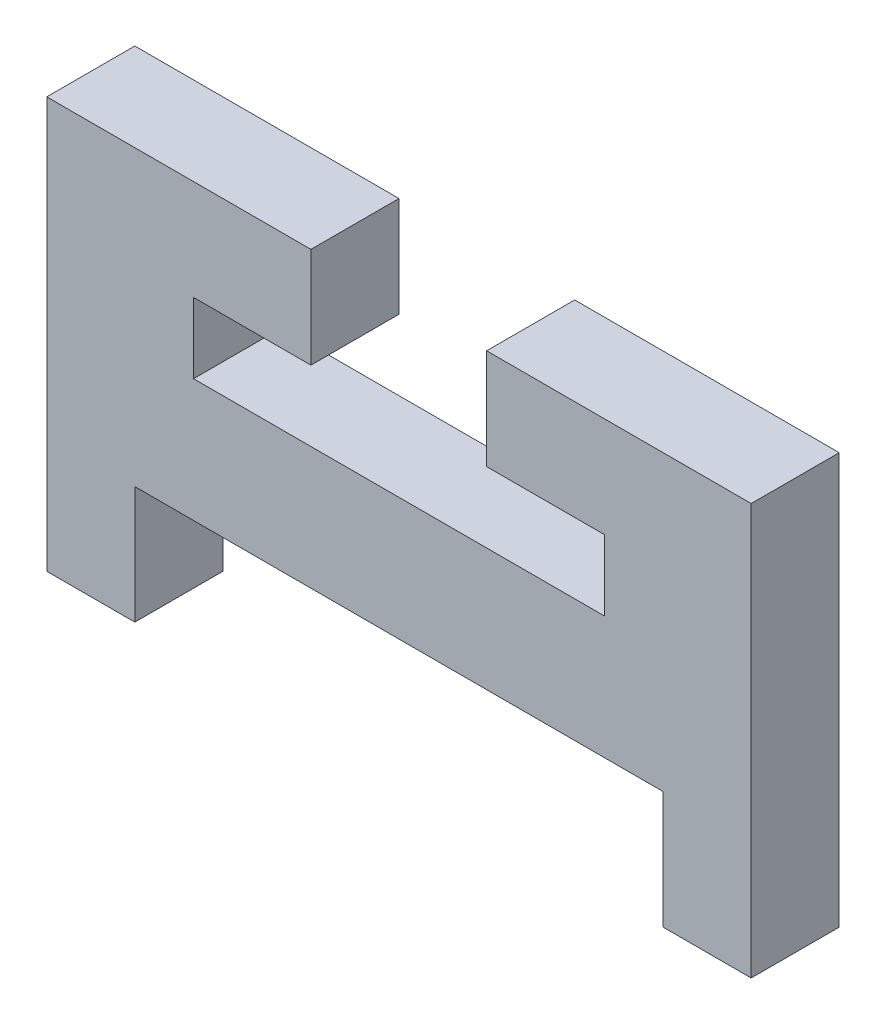
ISO-10303-21;
HEADER;
FILE_DESCRIPTION(('STEP AP214'),'2;1');
FILE_NAME('part.step','',(''),(''),'','','');
FILE_SCHEMA(('AUTOMOTIVE_DESIGN { 1 0 10303 214 1 1 1 1 }'));
ENDSEC;
DATA;
#1=APPLICATION_CONTEXT('core data for automotive mechanical design processes');
#2=APPLICATION_PROTOCOL_DEFINITION('international standard','automotive_design',2000,#1);
#3=PRODUCT_CONTEXT('',#1,'mechanical');
#4=PRODUCT('Part','Part','',(#3));
#5=PRODUCT_RELATED_PRODUCT_CATEGORY('part','',(#4));
#6=PRODUCT_DEFINITION_FORMATION('','',#4);
#7=PRODUCT_DEFINITION_CONTEXT('part definition',#1,'design');
#8=PRODUCT_DEFINITION('design','',#6,#7);
#9=PRODUCT_DEFINITION_SHAPE('','',#8);
#10=(LENGTH_UNIT() NAMED_UNIT(*) SI_UNIT(.MILLI.,.METRE.));
#11=(NAMED_UNIT(*) PLANE_ANGLE_UNIT() SI_UNIT($,.RADIAN.));
#12=(NAMED_UNIT(*) SI_UNIT($,.STERADIAN.) SOLID_ANGLE_UNIT());
#13=UNCERTAINTY_MEASURE_WITH_UNIT(LENGTH_MEASURE(1.E-05),#10,'distance_accuracy_value','');
#14=(GEOMETRIC_REPRESENTATION_CONTEXT(3) GLOBAL_UNCERTAINTY_ASSIGNED_CONTEXT((#13)) GLOBAL_UNIT_ASSIGNED_CONTEXT((#10,
#11,#12)) REPRESENTATION_CONTEXT('',''));
#15=CARTESIAN_POINT('',(0.,0.,0.));
#16=DIRECTION('',(0.,0.,1.));
#17=DIRECTION('',(1.,0.,0.));
#18=AXIS2_PLACEMENT_3D('',#15,#16,#17);
#19=CARTESIAN_POINT('',(25.9,16.3026832944775,3.));
#20=DIRECTION('',(-1.,0.,0.));
#21=DIRECTION('',(0.,0.,1.));
#22=AXIS2_PLACEMENT_3D('',#19,#20,#21);
#23=PLANE('',#22);
#24=DIRECTION('',(0.,1.,0.));
#25=VECTOR('',#24,1.);
#26=CARTESIAN_POINT('',(25.9,16.3026832944775,0.));
#27=LINE('',#26,#25);
#28=CARTESIAN_POINT('',(25.9,16.3026832944775,0.));
#29=VERTEX_POINT('',#28);
#30=CARTESIAN_POINT('',(25.9,18.7026832944775,0.));
#31=VERTEX_POINT('',#30);
#32=EDGE_CURVE('E177',#29,#31,#27,.T.);
#33=ORIENTED_EDGE('',*,*,#32,.T.);
#34=DIRECTION('',(0.,0.,-1.));
#35=VECTOR('',#34,1.);
#36=CARTESIAN_POINT('',(25.9,18.7026832944775,3.));
#37=LINE('',#36,#35);
#38=CARTESIAN_POINT('',(25.9,18.7026832944775,3.));
#39=VERTEX_POINT('',#38);
#40=EDGE_CURVE('E41',#39,#31,#37,.T.);
#41=ORIENTED_EDGE('',*,*,#40,.F.);
#42=DIRECTION('',(0.,1.,0.));
#43=VECTOR('',#42,1.);
#44=CARTESIAN_POINT('',(25.9,16.3026832944775,3.));
#45=LINE('',#44,#43);
#46=CARTESIAN_POINT('',(25.9,16.3026832944775,3.));
#47=VERTEX_POINT('',#46);
#48=EDGE_CURVE('E294',#47,#39,#45,.T.);
#49=ORIENTED_EDGE('',*,*,#48,.F.);
#50=DIRECTION('',(0.,0.,-1.));
#51=VECTOR('',#50,1.);
#52=CARTESIAN_POINT('',(25.9,16.3026832944775,3.));
#53=LINE('',#52,#51);
#54=EDGE_CURVE('E11',#47,#29,#53,.T.);
#55=ORIENTED_EDGE('',*,*,#54,.T.);
#56=EDGE_LOOP('',(#33,#41,#49,#55));
#57=FACE_BOUND('',#56,.T.);
#58=ADVANCED_FACE('F33',(#57),#23,.F.);
#59=CARTESIAN_POINT('',(25.9,18.7026832944775,3.));
#60=DIRECTION('',(0.,1.,0.));
#61=DIRECTION('',(0.,0.,1.));
#62=AXIS2_PLACEMENT_3D('',#59,#60,#61);
#63=PLANE('',#62);
#64=DIRECTION('',(1.,0.,0.));
#65=VECTOR('',#64,1.);
#66=CARTESIAN_POINT('',(25.9,18.7026832944775,0.));
#67=LINE('',#66,#65);
#68=CARTESIAN_POINT('',(29.9,18.7026832944775,0.));
#69=VERTEX_POINT('',#68);
#70=EDGE_CURVE('E179',#31,#69,#67,.T.);
#71=ORIENTED_EDGE('',*,*,#70,.T.);
#72=DIRECTION('',(0.,0.,-1.));
#73=VECTOR('',#72,1.);
#74=CARTESIAN_POINT('',(29.9,18.7026832944775,3.));
#75=LINE('',#74,#73);
#76=CARTESIAN_POINT('',(29.9,18.7026832944775,3.));
#77=VERTEX_POINT('',#76);
#78=EDGE_CURVE('E236',#77,#69,#75,.T.);
#79=ORIENTED_EDGE('',*,*,#78,.F.);
#80=DIRECTION('',(1.,0.,0.));
#81=VECTOR('',#80,1.);
#82=CARTESIAN_POINT('',(25.9,18.7026832944775,3.));
#83=LINE('',#82,#81);
#84=EDGE_CURVE('E245',#39,#77,#83,.T.);
#85=ORIENTED_EDGE('',*,*,#84,.F.);
#86=ORIENTED_EDGE('',*,*,#40,.T.);
#87=EDGE_LOOP('',(#71,#79,#85,#86));
#88=FACE_BOUND('',#87,.T.);
#89=ADVANCED_FACE('F243',(#88),#63,.F.);
#90=CARTESIAN_POINT('',(29.9,18.7026832944775,3.));
#91=DIRECTION('',(-1.,0.,0.));
#92=DIRECTION('',(0.,0.,1.));
#93=AXIS2_PLACEMENT_3D('',#90,#91,#92);
#94=PLANE('',#93);
#95=DIRECTION('',(0.,1.,0.));
#96=VECTOR('',#95,1.);
#97=CARTESIAN_POINT('',(29.9,18.7026832944775,0.));
#98=LINE('',#97,#96);
#99=CARTESIAN_POINT('',(29.9,22.12,0.));
#100=VERTEX_POINT('',#99);
#101=EDGE_CURVE('E181',#69,#100,#98,.T.);
#102=ORIENTED_EDGE('',*,*,#101,.T.);
#103=DIRECTION('',(0.,0.,-1.));
#104=VECTOR('',#103,1.);
#105=CARTESIAN_POINT('',(29.9,22.12,3.));
#106=LINE('',#105,#104);
#107=CARTESIAN_POINT('',(29.9,22.12,3.));
#108=VERTEX_POINT('',#107);
#109=EDGE_CURVE('E233',#108,#100,#106,.T.);
#110=ORIENTED_EDGE('',*,*,#109,.F.);
#111=DIRECTION('',(0.,1.,0.));
#112=VECTOR('',#111,1.);
#113=CARTESIAN_POINT('',(29.9,18.7026832944775,3.));
#114=LINE('',#113,#112);
#115=EDGE_CURVE('E266',#77,#108,#114,.T.);
#116=ORIENTED_EDGE('',*,*,#115,.F.);
#117=ORIENTED_EDGE('',*,*,#78,.T.);
#118=EDGE_LOOP('',(#102,#110,#116,#117));
#119=FACE_BOUND('',#118,.T.);
#120=ADVANCED_FACE('F257',(#119),#94,.F.);
#121=CARTESIAN_POINT('',(29.9,22.12,3.));
#122=DIRECTION('',(0.,-1.,0.));
#123=DIRECTION('',(0.,0.,-1.));
#124=AXIS2_PLACEMENT_3D('',#121,#122,#123);
#125=PLANE('',#124);
#126=DIRECTION('',(-1.,0.,0.));
#127=VECTOR('',#126,1.);
#128=CARTESIAN_POINT('',(29.9,22.12,0.));
#129=LINE('',#128,#127);
#130=CARTESIAN_POINT('',(20.9,22.12,0.));
#131=VERTEX_POINT('',#130);
#132=EDGE_CURVE('E183',#100,#131,#129,.T.);
#133=ORIENTED_EDGE('',*,*,#132,.T.);
#134=DIRECTION('',(0.,0.,-1.));
#135=VECTOR('',#134,1.);
#136=CARTESIAN_POINT('',(20.9,22.12,3.));
#137=LINE('',#136,#135);
#138=CARTESIAN_POINT('',(20.9,22.12,3.));
#139=VERTEX_POINT('',#138);
#140=EDGE_CURVE('E230',#139,#131,#137,.T.);
#141=ORIENTED_EDGE('',*,*,#140,.F.);
#142=DIRECTION('',(-1.,0.,0.));
#143=VECTOR('',#142,1.);
#144=CARTESIAN_POINT('',(29.9,22.12,3.));
#145=LINE('',#144,#143);
#146=EDGE_CURVE('E263',#108,#139,#145,.T.);
#147=ORIENTED_EDGE('',*,*,#146,.F.);
#148=ORIENTED_EDGE('',*,*,#109,.T.);
#149=EDGE_LOOP('',(#133,#141,#147,#148));
#150=FACE_BOUND('',#149,.T.);
#151=ADVANCED_FACE('F261',(#150),#125,.F.);
#152=CARTESIAN_POINT('',(20.9,22.12,3.));
#153=DIRECTION('',(1.,0.,0.));
#154=DIRECTION('',(0.,0.,-1.));
#155=AXIS2_PLACEMENT_3D('',#152,#153,#154);
#156=PLANE('',#155);
#157=DIRECTION('',(0.,-1.,0.));
#158=VECTOR('',#157,1.);
#159=CARTESIAN_POINT('',(20.9,22.12,0.));
#160=LINE('',#159,#158);
#161=CARTESIAN_POINT('',(20.9,8.12000000000002,0.));
#162=VERTEX_POINT('',#161);
#163=EDGE_CURVE('E185',#131,#162,#160,.T.);
#164=ORIENTED_EDGE('',*,*,#163,.T.);
#165=DIRECTION('',(0.,0.,-1.));
#166=VECTOR('',#165,1.);
#167=CARTESIAN_POINT('',(20.9,8.12000000000002,3.));
#168=LINE('',#167,#166);
#169=CARTESIAN_POINT('',(20.9,8.12000000000002,3.));
#170=VERTEX_POINT('',#169);
#171=EDGE_CURVE('E227',#170,#162,#168,.T.);
#172=ORIENTED_EDGE('',*,*,#171,.F.);
#173=DIRECTION('',(0.,-1.,0.));
#174=VECTOR('',#173,1.);
#175=CARTESIAN_POINT('',(20.9,22.12,3.));
#176=LINE('',#175,#174);
#177=EDGE_CURVE('E265',#139,#170,#176,.T.);
#178=ORIENTED_EDGE('',*,*,#177,.F.);
#179=ORIENTED_EDGE('',*,*,#140,.T.);
#180=EDGE_LOOP('',(#164,#172,#178,#179));
#181=FACE_BOUND('',#180,.T.);
#182=ADVANCED_FACE('F308',(#181),#156,.F.);
#183=CARTESIAN_POINT('',(20.9,8.12000000000002,3.));
#184=DIRECTION('',(0.,1.,0.));
#185=DIRECTION('',(0.,0.,1.));
#186=AXIS2_PLACEMENT_3D('',#183,#184,#185);
#187=PLANE('',#186);
#188=DIRECTION('',(1.,0.,0.));
#189=VECTOR('',#188,1.);
#190=CARTESIAN_POINT('',(20.9,8.12000000000002,0.));
#191=LINE('',#190,#189);
#192=CARTESIAN_POINT('',(23.9,8.12000000000002,0.));
#193=VERTEX_POINT('',#192);
#194=EDGE_CURVE('E187',#162,#193,#191,.T.);
#195=ORIENTED_EDGE('',*,*,#194,.T.);
#196=DIRECTION('',(0.,0.,-1.));
#197=VECTOR('',#196,1.);
#198=CARTESIAN_POINT('',(23.9,8.12000000000002,3.));
#199=LINE('',#198,#197);
#200=CARTESIAN_POINT('',(23.9,8.12000000000002,3.));
#201=VERTEX_POINT('',#200);
#202=EDGE_CURVE('E224',#201,#193,#199,.T.);
#203=ORIENTED_EDGE('',*,*,#202,.F.);
#204=DIRECTION('',(1.,0.,0.));
#205=VECTOR('',#204,1.);
#206=CARTESIAN_POINT('',(20.9,8.12000000000002,3.));
#207=LINE('',#206,#205);
#208=EDGE_CURVE('E268',#170,#201,#207,.T.);
#209=ORIENTED_EDGE('',*,*,#208,.F.);
#210=ORIENTED_EDGE('',*,*,#171,.T.);
#211=EDGE_LOOP('',(#195,#203,#209,#210));
#212=FACE_BOUND('',#211,.T.);
#213=ADVANCED_FACE('F311',(#212),#187,.F.);
#214=CARTESIAN_POINT('',(23.9,8.12000000000002,3.));
#215=DIRECTION('',(-1.,0.,0.));
#216=DIRECTION('',(0.,0.,1.));
#217=AXIS2_PLACEMENT_3D('',#214,#215,#216);
#218=PLANE('',#217);
#219=DIRECTION('',(0.,1.,0.));
#220=VECTOR('',#219,1.);
#221=CARTESIAN_POINT('',(23.9,8.12000000000002,0.));
#222=LINE('',#221,#220);
#223=CARTESIAN_POINT('',(23.9,12.12,0.));
#224=VERTEX_POINT('',#223);
#225=EDGE_CURVE('E189',#193,#224,#222,.T.);
#226=ORIENTED_EDGE('',*,*,#225,.T.);
#227=DIRECTION('',(0.,0.,-1.));
#228=VECTOR('',#227,1.);
#229=CARTESIAN_POINT('',(23.9,12.12,3.));
#230=LINE('',#229,#228);
#231=CARTESIAN_POINT('',(23.9,12.12,3.));
#232=VERTEX_POINT('',#231);
#233=EDGE_CURVE('E221',#232,#224,#230,.T.);
#234=ORIENTED_EDGE('',*,*,#233,.F.);
#235=DIRECTION('',(0.,1.,0.));
#236=VECTOR('',#235,1.);
#237=CARTESIAN_POINT('',(23.9,8.12000000000002,3.));
#238=LINE('',#237,#236);
#239=EDGE_CURVE('E274',#201,#232,#238,.T.);
#240=ORIENTED_EDGE('',*,*,#239,.F.);
#241=ORIENTED_EDGE('',*,*,#202,.T.);
#242=EDGE_LOOP('',(#226,#234,#240,#241));
#243=FACE_BOUND('',#242,.T.);
#244=ADVANCED_FACE('F315',(#243),#218,.F.);
#245=CARTESIAN_POINT('',(23.9,12.12,3.));
#246=DIRECTION('',(0.,1.,0.));
#247=DIRECTION('',(0.,0.,1.));
#248=AXIS2_PLACEMENT_3D('',#245,#246,#247);
#249=PLANE('',#248);
#250=DIRECTION('',(1.,0.,0.));
#251=VECTOR('',#250,1.);
#252=CARTESIAN_POINT('',(23.9,12.12,0.));
#253=LINE('',#252,#251);
#254=CARTESIAN_POINT('',(41.8999999999999,12.12,0.));
#255=VERTEX_POINT('',#254);
#256=EDGE_CURVE('E191',#224,#255,#253,.T.);
#257=ORIENTED_EDGE('',*,*,#256,.T.);
#258=DIRECTION('',(0.,0.,-1.));
#259=VECTOR('',#258,1.);
#260=CARTESIAN_POINT('',(41.8999999999999,12.12,3.));
#261=LINE('',#260,#259);
#262=CARTESIAN_POINT('',(41.8999999999999,12.12,3.));
#263=VERTEX_POINT('',#262);
#264=EDGE_CURVE('E218',#263,#255,#261,.T.);
#265=ORIENTED_EDGE('',*,*,#264,.F.);
#266=DIRECTION('',(1.,0.,0.));
#267=VECTOR('',#266,1.);
#268=CARTESIAN_POINT('',(23.9,12.12,3.));
#269=LINE('',#268,#267);
#270=EDGE_CURVE('E276',#232,#263,#269,.T.);
#271=ORIENTED_EDGE('',*,*,#270,.F.);
#272=ORIENTED_EDGE('',*,*,#233,.T.);
#273=EDGE_LOOP('',(#257,#265,#271,#272));
#274=FACE_BOUND('',#273,.T.);
#275=ADVANCED_FACE('F319',(#274),#249,.F.);
#276=CARTESIAN_POINT('',(41.8999999999999,12.12,3.));
#277=DIRECTION('',(1.,0.,0.));
#278=DIRECTION('',(0.,0.,-1.));
#279=AXIS2_PLACEMENT_3D('',#276,#277,#278);
#280=PLANE('',#279);
#281=DIRECTION('',(0.,-1.,0.));
#282=VECTOR('',#281,1.);
#283=CARTESIAN_POINT('',(41.8999999999999,12.12,0.));
#284=LINE('',#283,#282);
#285=CARTESIAN_POINT('',(41.8999999999999,8.12000000000002,0.));
#286=VERTEX_POINT('',#285);
#287=EDGE_CURVE('E193',#255,#286,#284,.T.);
#288=ORIENTED_EDGE('',*,*,#287,.T.);
#289=DIRECTION('',(0.,0.,-1.));
#290=VECTOR('',#289,1.);
#291=CARTESIAN_POINT('',(41.8999999999999,8.12000000000002,3.));
#292=LINE('',#291,#290);
#293=CARTESIAN_POINT('',(41.8999999999999,8.12000000000002,3.));
#294=VERTEX_POINT('',#293);
#295=EDGE_CURVE('E215',#294,#286,#292,.T.);
#296=ORIENTED_EDGE('',*,*,#295,.F.);
#297=DIRECTION('',(0.,-1.,0.));
#298=VECTOR('',#297,1.);
#299=CARTESIAN_POINT('',(41.8999999999999,12.12,3.));
#300=LINE('',#299,#298);
#301=EDGE_CURVE('E278',#263,#294,#300,.T.);
#302=ORIENTED_EDGE('',*,*,#301,.F.);
#303=ORIENTED_EDGE('',*,*,#264,.T.);
#304=EDGE_LOOP('',(#288,#296,#302,#303));
#305=FACE_BOUND('',#304,.T.);
#306=ADVANCED_FACE('F323',(#305),#280,.F.);
#307=CARTESIAN_POINT('',(41.8999999999999,8.12000000000002,3.));
#308=DIRECTION('',(0.,1.,0.));
#309=DIRECTION('',(0.,0.,1.));
#310=AXIS2_PLACEMENT_3D('',#307,#308,#309);
#311=PLANE('',#310);
#312=DIRECTION('',(1.,0.,0.));
#313=VECTOR('',#312,1.);
#314=CARTESIAN_POINT('',(41.8999999999999,8.12000000000002,0.));
#315=LINE('',#314,#313);
#316=CARTESIAN_POINT('',(44.9,8.12000000000002,0.));
#317=VERTEX_POINT('',#316);
#318=EDGE_CURVE('E195',#286,#317,#315,.T.);
#319=ORIENTED_EDGE('',*,*,#318,.T.);
#320=DIRECTION('',(0.,0.,-1.));
#321=VECTOR('',#320,1.);
#322=CARTESIAN_POINT('',(44.9,8.12000000000002,3.));
#323=LINE('',#322,#321);
#324=CARTESIAN_POINT('',(44.9,8.12000000000002,3.));
#325=VERTEX_POINT('',#324);
#326=EDGE_CURVE('E212',#325,#317,#323,.T.);
#327=ORIENTED_EDGE('',*,*,#326,.F.);
#328=DIRECTION('',(1.,0.,0.));
#329=VECTOR('',#328,1.);
#330=CARTESIAN_POINT('',(41.8999999999999,8.12000000000002,3.));
#331=LINE('',#330,#329);
#332=EDGE_CURVE('E280',#294,#325,#331,.T.);
#333=ORIENTED_EDGE('',*,*,#332,.F.);
#334=ORIENTED_EDGE('',*,*,#295,.T.);
#335=EDGE_LOOP('',(#319,#327,#333,#334));
#336=FACE_BOUND('',#335,.T.);
#337=ADVANCED_FACE('F327',(#336),#311,.F.);
#338=CARTESIAN_POINT('',(44.9,8.12000000000002,3.));
#339=DIRECTION('',(-1.,0.,0.));
#340=DIRECTION('',(0.,0.,1.));
#341=AXIS2_PLACEMENT_3D('',#338,#339,#340);
#342=PLANE('',#341);
#343=DIRECTION('',(0.,1.,0.));
#344=VECTOR('',#343,1.);
#345=CARTESIAN_POINT('',(44.9,8.12000000000002,0.));
#346=LINE('',#345,#344);
#347=CARTESIAN_POINT('',(44.9,22.12,0.));
#348=VERTEX_POINT('',#347);
#349=EDGE_CURVE('E197',#317,#348,#346,.T.);
#350=ORIENTED_EDGE('',*,*,#349,.T.);
#351=DIRECTION('',(0.,0.,-1.));
#352=VECTOR('',#351,1.);
#353=CARTESIAN_POINT('',(44.9,22.12,3.));
#354=LINE('',#353,#352);
#355=CARTESIAN_POINT('',(44.9,22.12,3.));
#356=VERTEX_POINT('',#355);
#357=EDGE_CURVE('E209',#356,#348,#354,.T.);
#358=ORIENTED_EDGE('',*,*,#357,.F.);
#359=DIRECTION('',(0.,1.,0.));
#360=VECTOR('',#359,1.);
#361=CARTESIAN_POINT('',(44.9,8.12000000000002,3.));
#362=LINE('',#361,#360);
#363=EDGE_CURVE('E282',#325,#356,#362,.T.);
#364=ORIENTED_EDGE('',*,*,#363,.F.);
#365=ORIENTED_EDGE('',*,*,#326,.T.);
#366=EDGE_LOOP('',(#350,#358,#364,#365));
#367=FACE_BOUND('',#366,.T.);
#368=ADVANCED_FACE('F288',(#367),#342,.F.);
#369=CARTESIAN_POINT('',(44.9,22.12,3.));
#370=DIRECTION('',(0.,-1.,0.));
#371=DIRECTION('',(0.,0.,-1.));
#372=AXIS2_PLACEMENT_3D('',#369,#370,#371);
#373=PLANE('',#372);
#374=DIRECTION('',(-1.,0.,0.));
#375=VECTOR('',#374,1.);
#376=CARTESIAN_POINT('',(44.9,22.12,0.));
#377=LINE('',#376,#375);
#378=CARTESIAN_POINT('',(35.8863854020223,22.12,0.));
#379=VERTEX_POINT('',#378);
#380=EDGE_CURVE('E199',#348,#379,#377,.T.);
#381=ORIENTED_EDGE('',*,*,#380,.T.);
#382=DIRECTION('',(0.,0.,-1.));
#383=VECTOR('',#382,1.);
#384=CARTESIAN_POINT('',(35.8863854020223,22.12,3.));
#385=LINE('',#384,#383);
#386=CARTESIAN_POINT('',(35.8863854020223,22.12,3.));
#387=VERTEX_POINT('',#386);
#388=EDGE_CURVE('E166',#387,#379,#385,.T.);
#389=ORIENTED_EDGE('',*,*,#388,.F.);
#390=DIRECTION('',(-1.,0.,0.));
#391=VECTOR('',#390,1.);
#392=CARTESIAN_POINT('',(44.9,22.12,3.));
#393=LINE('',#392,#391);
#394=EDGE_CURVE('E157',#356,#387,#393,.T.);
#395=ORIENTED_EDGE('',*,*,#394,.F.);
#396=ORIENTED_EDGE('',*,*,#357,.T.);
#397=EDGE_LOOP('',(#381,#389,#395,#396));
#398=FACE_BOUND('',#397,.T.);
#399=ADVANCED_FACE('F292',(#398),#373,.F.);
#400=CARTESIAN_POINT('',(35.8863854020223,22.12,3.));
#401=DIRECTION('',(1.,0.,0.));
#402=DIRECTION('',(0.,0.,-1.));
#403=AXIS2_PLACEMENT_3D('',#400,#401,#402);
#404=PLANE('',#403);
#405=DIRECTION('',(0.,-1.,0.));
#406=VECTOR('',#405,1.);
#407=CARTESIAN_POINT('',(35.8863854020223,22.12,0.));
#408=LINE('',#407,#406);
#409=CARTESIAN_POINT('',(35.8863854020223,18.7026832944775,0.));
#410=VERTEX_POINT('',#409);
#411=EDGE_CURVE('E165',#379,#410,#408,.T.);
#412=ORIENTED_EDGE('',*,*,#411,.T.);
#413=DIRECTION('',(0.,0.,-1.));
#414=VECTOR('',#413,1.);
#415=CARTESIAN_POINT('',(35.8863854020223,18.7026832944775,3.));
#416=LINE('',#415,#414);
#417=CARTESIAN_POINT('',(35.8863854020223,18.7026832944775,3.));
#418=VERTEX_POINT('',#417);
#419=EDGE_CURVE('E162',#418,#410,#416,.T.);
#420=ORIENTED_EDGE('',*,*,#419,.F.);
#421=DIRECTION('',(0.,-1.,0.));
#422=VECTOR('',#421,1.);
#423=CARTESIAN_POINT('',(35.8863854020223,22.12,3.));
#424=LINE('',#423,#422);
#425=EDGE_CURVE('E151',#387,#418,#424,.T.);
#426=ORIENTED_EDGE('',*,*,#425,.F.);
#427=ORIENTED_EDGE('',*,*,#388,.T.);
#428=EDGE_LOOP('',(#412,#420,#426,#427));
#429=FACE_BOUND('',#428,.T.);
#430=ADVANCED_FACE('F163',(#429),#404,.F.);
#431=CARTESIAN_POINT('',(35.8863854020223,18.7026832944775,3.));
#432=DIRECTION('',(0.,1.,0.));
#433=DIRECTION('',(0.,0.,1.));
#434=AXIS2_PLACEMENT_3D('',#431,#432,#433);
#435=PLANE('',#434);
#436=DIRECTION('',(1.,0.,0.));
#437=VECTOR('',#436,1.);
#438=CARTESIAN_POINT('',(35.8863854020223,18.7026832944775,0.));
#439=LINE('',#438,#437);
#440=CARTESIAN_POINT('',(39.9,18.7026832944775,0.));
#441=VERTEX_POINT('',#440);
#442=EDGE_CURVE('E103',#410,#441,#439,.T.);
#443=ORIENTED_EDGE('',*,*,#442,.T.);
#444=DIRECTION('',(0.,0.,-1.));
#445=VECTOR('',#444,1.);
#446=CARTESIAN_POINT('',(39.9,18.7026832944775,3.));
#447=LINE('',#446,#445);
#448=CARTESIAN_POINT('',(39.9,18.7026832944775,3.));
#449=VERTEX_POINT('',#448);
#450=EDGE_CURVE('E167',#449,#441,#447,.T.);
#451=ORIENTED_EDGE('',*,*,#450,.F.);
#452=DIRECTION('',(1.,0.,0.));
#453=VECTOR('',#452,1.);
#454=CARTESIAN_POINT('',(35.8863854020223,18.7026832944775,3.));
#455=LINE('',#454,#453);
#456=EDGE_CURVE('E155',#418,#449,#455,.T.);
#457=ORIENTED_EDGE('',*,*,#456,.F.);
#458=ORIENTED_EDGE('',*,*,#419,.T.);
#459=EDGE_LOOP('',(#443,#451,#457,#458));
#460=FACE_BOUND('',#459,.T.);
#461=ADVANCED_FACE('F169',(#460),#435,.F.);
#462=CARTESIAN_POINT('',(39.9,18.7026832944775,3.));
#463=DIRECTION('',(1.,0.,0.));
#464=DIRECTION('',(0.,0.,-1.));
#465=AXIS2_PLACEMENT_3D('',#462,#463,#464);
#466=PLANE('',#465);
#467=DIRECTION('',(0.,-1.,0.));
#468=VECTOR('',#467,1.);
#469=CARTESIAN_POINT('',(39.9,18.7026832944775,0.));
#470=LINE('',#469,#468);
#471=CARTESIAN_POINT('',(39.9,16.3026832944775,0.));
#472=VERTEX_POINT('',#471);
#473=EDGE_CURVE('E110',#441,#472,#470,.T.);
#474=ORIENTED_EDGE('',*,*,#473,.T.);
#475=DIRECTION('',(0.,0.,-1.));
#476=VECTOR('',#475,1.);
#477=CARTESIAN_POINT('',(39.9,16.3026832944775,3.));
#478=LINE('',#477,#476);
#479=CARTESIAN_POINT('',(39.9,16.3026832944775,3.));
#480=VERTEX_POINT('',#479);
#481=EDGE_CURVE('E173',#480,#472,#478,.T.);
#482=ORIENTED_EDGE('',*,*,#481,.F.);
#483=DIRECTION('',(0.,-1.,0.));
#484=VECTOR('',#483,1.);
#485=CARTESIAN_POINT('',(39.9,18.7026832944775,3.));
#486=LINE('',#485,#484);
#487=EDGE_CURVE('E171',#449,#480,#486,.T.);
#488=ORIENTED_EDGE('',*,*,#487,.F.);
#489=ORIENTED_EDGE('',*,*,#450,.T.);
#490=EDGE_LOOP('',(#474,#482,#488,#489));
#491=FACE_BOUND('',#490,.T.);
#492=ADVANCED_FACE('F340',(#491),#466,.F.);
#493=CARTESIAN_POINT('',(39.9,16.3026832944775,3.));
#494=DIRECTION('',(0.,-1.,0.));
#495=DIRECTION('',(0.,0.,-1.));
#496=AXIS2_PLACEMENT_3D('',#493,#494,#495);
#497=PLANE('',#496);
#498=DIRECTION('',(-1.,0.,0.));
#499=VECTOR('',#498,1.);
#500=CARTESIAN_POINT('',(39.9,16.3026832944775,0.));
#501=LINE('',#500,#499);
#502=EDGE_CURVE('E204',#472,#29,#501,.T.);
#503=ORIENTED_EDGE('',*,*,#502,.T.);
#504=ORIENTED_EDGE('',*,*,#54,.F.);
#505=DIRECTION('',(-1.,0.,0.));
#506=VECTOR('',#505,1.);
#507=CARTESIAN_POINT('',(32.4,16.3026832944775,3.));
#508=LINE('',#507,#506);
#509=EDGE_CURVE('E49',#480,#47,#508,.T.);
#510=ORIENTED_EDGE('',*,*,#509,.F.);
#511=ORIENTED_EDGE('',*,*,#481,.T.);
#512=EDGE_LOOP('',(#503,#504,#510,#511));
#513=FACE_BOUND('',#512,.T.);
#514=ADVANCED_FACE('F293',(#513),#497,.F.);
#515=CARTESIAN_POINT('',(0.,0.,3.));
#516=DIRECTION('',(0.,0.,-1.));
#517=DIRECTION('',(-1.,0.,0.));
#518=AXIS2_PLACEMENT_3D('',#515,#516,#517);
#519=PLANE('',#518);
#520=ORIENTED_EDGE('',*,*,#509,.T.);
#521=ORIENTED_EDGE('',*,*,#48,.T.);
#522=ORIENTED_EDGE('',*,*,#84,.T.);
#523=ORIENTED_EDGE('',*,*,#115,.T.);
#524=ORIENTED_EDGE('',*,*,#146,.T.);
#525=ORIENTED_EDGE('',*,*,#177,.T.);
#526=ORIENTED_EDGE('',*,*,#208,.T.);
#527=ORIENTED_EDGE('',*,*,#239,.T.);
#528=ORIENTED_EDGE('',*,*,#270,.T.);
#529=ORIENTED_EDGE('',*,*,#301,.T.);
#530=ORIENTED_EDGE('',*,*,#332,.T.);
#531=ORIENTED_EDGE('',*,*,#363,.T.);
#532=ORIENTED_EDGE('',*,*,#394,.T.);
#533=ORIENTED_EDGE('',*,*,#425,.T.);
#534=ORIENTED_EDGE('',*,*,#456,.T.);
#535=ORIENTED_EDGE('',*,*,#487,.T.);
#536=EDGE_LOOP('',(#520,#521,#522,#523,#524,#525,#526,#527,#528,#529,#530,#531,#532,#533,#534,#535));
#537=FACE_BOUND('',#536,.T.);
#538=ADVANCED_FACE('F153',(#537),#519,.F.);
#539=CARTESIAN_POINT('',(0.,0.,0.));
#540=DIRECTION('',(0.,0.,-1.));
#541=DIRECTION('',(-1.,0.,0.));
#542=AXIS2_PLACEMENT_3D('',#539,#540,#541);
#543=PLANE('',#542);
#544=ORIENTED_EDGE('',*,*,#32,.F.);
#545=ORIENTED_EDGE('',*,*,#502,.F.);
#546=ORIENTED_EDGE('',*,*,#473,.F.);
#547=ORIENTED_EDGE('',*,*,#442,.F.);
#548=ORIENTED_EDGE('',*,*,#411,.F.);
#549=ORIENTED_EDGE('',*,*,#380,.F.);
#550=ORIENTED_EDGE('',*,*,#349,.F.);
#551=ORIENTED_EDGE('',*,*,#318,.F.);
#552=ORIENTED_EDGE('',*,*,#287,.F.);
#553=ORIENTED_EDGE('',*,*,#256,.F.);
#554=ORIENTED_EDGE('',*,*,#225,.F.);
#555=ORIENTED_EDGE('',*,*,#194,.F.);
#556=ORIENTED_EDGE('',*,*,#163,.F.);
#557=ORIENTED_EDGE('',*,*,#132,.F.);
#558=ORIENTED_EDGE('',*,*,#101,.F.);
#559=ORIENTED_EDGE('',*,*,#70,.F.);
#560=EDGE_LOOP('',(#544,#545,#546,#547,#548,#549,#550,#551,#552,#553,#554,#555,#556,#557,#558,#559));
#561=FACE_BOUND('',#560,.T.);
#562=ADVANCED_FACE('F251',(#561),#543,.T.);
#563=CLOSED_SHELL('',(#58,#89,#120,#151,#182,#213,#244,#275,#306,#337,#368,#399,#430,#461,#492,
#514,#538,#562));
#564=MANIFOLD_SOLID_BREP('B2',#563);
#565=ADVANCED_BREP_SHAPE_REPRESENTATION('',(#18,#564),#14);
#566=SHAPE_DEFINITION_REPRESENTATION(#9,#565);
ENDSEC;
END-ISO-10303-21;
